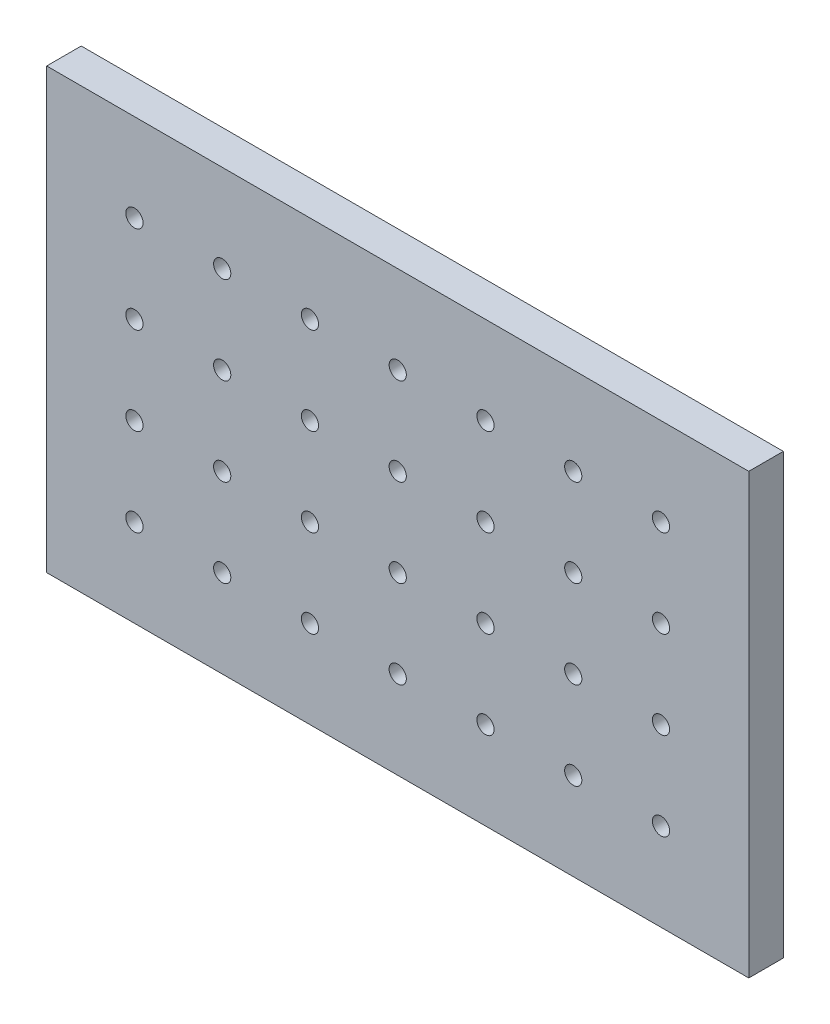
ISO-10303-21;
HEADER;
FILE_DESCRIPTION(('STEP AP214'),'2;1');
FILE_NAME('part.step','',(''),(''),'','','');
FILE_SCHEMA(('AUTOMOTIVE_DESIGN { 1 0 10303 214 1 1 1 1 }'));
ENDSEC;
DATA;
#1=APPLICATION_CONTEXT('core data for automotive mechanical design processes');
#2=APPLICATION_PROTOCOL_DEFINITION('international standard','automotive_design',2000,#1);
#3=PRODUCT_CONTEXT('',#1,'mechanical');
#4=PRODUCT('Part','Part','',(#3));
#5=PRODUCT_RELATED_PRODUCT_CATEGORY('part','',(#4));
#6=PRODUCT_DEFINITION_FORMATION('','',#4);
#7=PRODUCT_DEFINITION_CONTEXT('part definition',#1,'design');
#8=PRODUCT_DEFINITION('design','',#6,#7);
#9=PRODUCT_DEFINITION_SHAPE('','',#8);
#10=(LENGTH_UNIT() NAMED_UNIT(*) SI_UNIT(.MILLI.,.METRE.));
#11=(NAMED_UNIT(*) PLANE_ANGLE_UNIT() SI_UNIT($,.RADIAN.));
#12=(NAMED_UNIT(*) SI_UNIT($,.STERADIAN.) SOLID_ANGLE_UNIT());
#13=UNCERTAINTY_MEASURE_WITH_UNIT(LENGTH_MEASURE(1.E-05),#10,'distance_accuracy_value','');
#14=(GEOMETRIC_REPRESENTATION_CONTEXT(3) GLOBAL_UNCERTAINTY_ASSIGNED_CONTEXT((#13)) GLOBAL_UNIT_ASSIGNED_CONTEXT((#10,
#11,#12)) REPRESENTATION_CONTEXT('',''));
#15=CARTESIAN_POINT('',(0.,0.,0.));
#16=DIRECTION('',(0.,0.,1.));
#17=DIRECTION('',(1.,0.,0.));
#18=AXIS2_PLACEMENT_3D('',#15,#16,#17);
#19=CARTESIAN_POINT('',(0.,0.,10.));
#20=DIRECTION('',(-1.,0.,0.));
#21=DIRECTION('',(0.,-1.,0.));
#22=AXIS2_PLACEMENT_3D('',#19,#20,#21);
#23=PLANE('',#22);
#24=DIRECTION('',(0.,1.,0.));
#25=VECTOR('',#24,1.);
#26=CARTESIAN_POINT('',(0.,0.,0.));
#27=LINE('',#26,#25);
#28=CARTESIAN_POINT('',(0.,-127.,0.));
#29=VERTEX_POINT('',#28);
#30=CARTESIAN_POINT('',(0.,0.,0.));
#31=VERTEX_POINT('',#30);
#32=EDGE_CURVE('E98',#29,#31,#27,.T.);
#33=ORIENTED_EDGE('',*,*,#32,.T.);
#34=DIRECTION('',(0.,0.,-1.));
#35=VECTOR('',#34,1.);
#36=CARTESIAN_POINT('',(0.,0.,10.));
#37=LINE('',#36,#35);
#38=CARTESIAN_POINT('',(0.,0.,10.));
#39=VERTEX_POINT('',#38);
#40=EDGE_CURVE('E11',#39,#31,#37,.T.);
#41=ORIENTED_EDGE('',*,*,#40,.F.);
#42=DIRECTION('',(0.,1.,0.));
#43=VECTOR('',#42,1.);
#44=CARTESIAN_POINT('',(0.,0.,10.));
#45=LINE('',#44,#43);
#46=CARTESIAN_POINT('',(0.,-127.,10.));
#47=VERTEX_POINT('',#46);
#48=EDGE_CURVE('E86',#47,#39,#45,.T.);
#49=ORIENTED_EDGE('',*,*,#48,.F.);
#50=DIRECTION('',(0.,0.,-1.));
#51=VECTOR('',#50,1.);
#52=CARTESIAN_POINT('',(0.,-127.,10.));
#53=LINE('',#52,#51);
#54=EDGE_CURVE('E94',#47,#29,#53,.T.);
#55=ORIENTED_EDGE('',*,*,#54,.T.);
#56=EDGE_LOOP('',(#33,#41,#49,#55));
#57=FACE_BOUND('',#56,.T.);
#58=ADVANCED_FACE('F35',(#57),#23,.F.);
#59=CARTESIAN_POINT('',(0.,0.,10.));
#60=DIRECTION('',(0.,-1.,0.));
#61=DIRECTION('',(1.,0.,0.));
#62=AXIS2_PLACEMENT_3D('',#59,#60,#61);
#63=PLANE('',#62);
#64=DIRECTION('',(-1.,0.,0.));
#65=VECTOR('',#64,1.);
#66=CARTESIAN_POINT('',(0.,0.,0.));
#67=LINE('',#66,#65);
#68=CARTESIAN_POINT('',(-203.2,0.,0.));
#69=VERTEX_POINT('',#68);
#70=EDGE_CURVE('E90',#31,#69,#67,.T.);
#71=ORIENTED_EDGE('',*,*,#70,.T.);
#72=DIRECTION('',(0.,0.,-1.));
#73=VECTOR('',#72,1.);
#74=CARTESIAN_POINT('',(-203.2,0.,10.));
#75=LINE('',#74,#73);
#76=CARTESIAN_POINT('',(-203.2,0.,10.));
#77=VERTEX_POINT('',#76);
#78=EDGE_CURVE('E43',#77,#69,#75,.T.);
#79=ORIENTED_EDGE('',*,*,#78,.F.);
#80=DIRECTION('',(-1.,0.,0.));
#81=VECTOR('',#80,1.);
#82=CARTESIAN_POINT('',(0.,0.,10.));
#83=LINE('',#82,#81);
#84=EDGE_CURVE('E81',#39,#77,#83,.T.);
#85=ORIENTED_EDGE('',*,*,#84,.F.);
#86=ORIENTED_EDGE('',*,*,#40,.T.);
#87=EDGE_LOOP('',(#71,#79,#85,#86));
#88=FACE_BOUND('',#87,.T.);
#89=ADVANCED_FACE('F89',(#88),#63,.F.);
#90=CARTESIAN_POINT('',(-203.2,0.,10.));
#91=DIRECTION('',(1.,0.,0.));
#92=DIRECTION('',(0.,1.,0.));
#93=AXIS2_PLACEMENT_3D('',#90,#91,#92);
#94=PLANE('',#93);
#95=DIRECTION('',(0.,-1.,0.));
#96=VECTOR('',#95,1.);
#97=CARTESIAN_POINT('',(-203.2,0.,0.));
#98=LINE('',#97,#96);
#99=CARTESIAN_POINT('',(-203.2,-127.,0.));
#100=VERTEX_POINT('',#99);
#101=EDGE_CURVE('E68',#69,#100,#98,.T.);
#102=ORIENTED_EDGE('',*,*,#101,.T.);
#103=DIRECTION('',(0.,0.,-1.));
#104=VECTOR('',#103,1.);
#105=CARTESIAN_POINT('',(-203.2,-127.,10.));
#106=LINE('',#105,#104);
#107=CARTESIAN_POINT('',(-203.2,-127.,10.));
#108=VERTEX_POINT('',#107);
#109=EDGE_CURVE('E91',#108,#100,#106,.T.);
#110=ORIENTED_EDGE('',*,*,#109,.F.);
#111=DIRECTION('',(0.,-1.,0.));
#112=VECTOR('',#111,1.);
#113=CARTESIAN_POINT('',(-203.2,0.,10.));
#114=LINE('',#113,#112);
#115=EDGE_CURVE('E84',#77,#108,#114,.T.);
#116=ORIENTED_EDGE('',*,*,#115,.F.);
#117=ORIENTED_EDGE('',*,*,#78,.T.);
#118=EDGE_LOOP('',(#102,#110,#116,#117));
#119=FACE_BOUND('',#118,.T.);
#120=ADVANCED_FACE('F92',(#119),#94,.F.);
#121=CARTESIAN_POINT('',(0.,-127.,10.));
#122=DIRECTION('',(0.,1.,0.));
#123=DIRECTION('',(-1.,0.,0.));
#124=AXIS2_PLACEMENT_3D('',#121,#122,#123);
#125=PLANE('',#124);
#126=DIRECTION('',(1.,0.,0.));
#127=VECTOR('',#126,1.);
#128=CARTESIAN_POINT('',(0.,-127.,0.));
#129=LINE('',#128,#127);
#130=EDGE_CURVE('E74',#100,#29,#129,.T.);
#131=ORIENTED_EDGE('',*,*,#130,.T.);
#132=ORIENTED_EDGE('',*,*,#54,.F.);
#133=DIRECTION('',(1.,0.,0.));
#134=VECTOR('',#133,1.);
#135=CARTESIAN_POINT('',(0.,-127.,10.));
#136=LINE('',#135,#134);
#137=EDGE_CURVE('E51',#108,#47,#136,.T.);
#138=ORIENTED_EDGE('',*,*,#137,.F.);
#139=ORIENTED_EDGE('',*,*,#109,.T.);
#140=EDGE_LOOP('',(#131,#132,#138,#139));
#141=FACE_BOUND('',#140,.T.);
#142=ADVANCED_FACE('F106',(#141),#125,.F.);
#143=CARTESIAN_POINT('',(0.,0.,10.));
#144=DIRECTION('',(0.,0.,-1.));
#145=DIRECTION('',(-1.,0.,0.));
#146=AXIS2_PLACEMENT_3D('',#143,#144,#145);
#147=PLANE('',#146);
#148=CARTESIAN_POINT('',(-177.799999999999,-101.6,10.));
#149=DIRECTION('',(0.,0.,1.));
#150=DIRECTION('',(1.,0.,0.));
#151=AXIS2_PLACEMENT_3D('',#148,#149,#150);
#152=CIRCLE('',#151,2.48999999999999);
#153=CARTESIAN_POINT('',(-175.309999999999,-101.6,10.));
#154=VERTEX_POINT('',#153);
#155=EDGE_CURVE('E271',#154,#154,#152,.T.);
#156=ORIENTED_EDGE('',*,*,#155,.F.);
#157=EDGE_LOOP('',(#156));
#158=FACE_BOUND('',#157,.T.);
#159=CARTESIAN_POINT('',(-177.799999999999,-76.2,10.));
#160=DIRECTION('',(0.,0.,1.));
#161=DIRECTION('',(1.,0.,0.));
#162=AXIS2_PLACEMENT_3D('',#159,#160,#161);
#163=CIRCLE('',#162,2.48999999999999);
#164=CARTESIAN_POINT('',(-175.309999999999,-76.2,10.));
#165=VERTEX_POINT('',#164);
#166=EDGE_CURVE('E265',#165,#165,#163,.T.);
#167=ORIENTED_EDGE('',*,*,#166,.F.);
#168=EDGE_LOOP('',(#167));
#169=FACE_BOUND('',#168,.T.);
#170=CARTESIAN_POINT('',(-177.8,-50.8,10.));
#171=DIRECTION('',(0.,0.,1.));
#172=DIRECTION('',(1.,0.,0.));
#173=AXIS2_PLACEMENT_3D('',#170,#171,#172);
#174=CIRCLE('',#173,2.48999999999999);
#175=CARTESIAN_POINT('',(-175.31,-50.8,10.));
#176=VERTEX_POINT('',#175);
#177=EDGE_CURVE('E259',#176,#176,#174,.T.);
#178=ORIENTED_EDGE('',*,*,#177,.F.);
#179=EDGE_LOOP('',(#178));
#180=FACE_BOUND('',#179,.T.);
#181=CARTESIAN_POINT('',(-25.3999999999993,-101.6,10.));
#182=DIRECTION('',(0.,0.,1.));
#183=DIRECTION('',(1.,0.,0.));
#184=AXIS2_PLACEMENT_3D('',#181,#182,#183);
#185=CIRCLE('',#184,2.49);
#186=CARTESIAN_POINT('',(-22.9099999999993,-101.6,10.));
#187=VERTEX_POINT('',#186);
#188=EDGE_CURVE('E253',#187,#187,#185,.T.);
#189=ORIENTED_EDGE('',*,*,#188,.F.);
#190=EDGE_LOOP('',(#189));
#191=FACE_BOUND('',#190,.T.);
#192=CARTESIAN_POINT('',(-50.7999999999993,-101.6,10.));
#193=DIRECTION('',(0.,0.,1.));
#194=DIRECTION('',(1.,0.,0.));
#195=AXIS2_PLACEMENT_3D('',#192,#193,#194);
#196=CIRCLE('',#195,2.49);
#197=CARTESIAN_POINT('',(-48.3099999999993,-101.6,10.));
#198=VERTEX_POINT('',#197);
#199=EDGE_CURVE('E247',#198,#198,#196,.T.);
#200=ORIENTED_EDGE('',*,*,#199,.F.);
#201=EDGE_LOOP('',(#200));
#202=FACE_BOUND('',#201,.T.);
#203=CARTESIAN_POINT('',(-76.1999999999993,-101.6,10.));
#204=DIRECTION('',(0.,0.,1.));
#205=DIRECTION('',(1.,0.,0.));
#206=AXIS2_PLACEMENT_3D('',#203,#204,#205);
#207=CIRCLE('',#206,2.49000000000001);
#208=CARTESIAN_POINT('',(-73.7099999999993,-101.6,10.));
#209=VERTEX_POINT('',#208);
#210=EDGE_CURVE('E241',#209,#209,#207,.T.);
#211=ORIENTED_EDGE('',*,*,#210,.F.);
#212=EDGE_LOOP('',(#211));
#213=FACE_BOUND('',#212,.T.);
#214=CARTESIAN_POINT('',(-101.599999999999,-101.6,10.));
#215=DIRECTION('',(0.,0.,1.));
#216=DIRECTION('',(1.,0.,0.));
#217=AXIS2_PLACEMENT_3D('',#214,#215,#216);
#218=CIRCLE('',#217,2.49000000000001);
#219=CARTESIAN_POINT('',(-99.1099999999993,-101.6,10.));
#220=VERTEX_POINT('',#219);
#221=EDGE_CURVE('E235',#220,#220,#218,.T.);
#222=ORIENTED_EDGE('',*,*,#221,.F.);
#223=EDGE_LOOP('',(#222));
#224=FACE_BOUND('',#223,.T.);
#225=CARTESIAN_POINT('',(-126.999999999999,-101.6,10.));
#226=DIRECTION('',(0.,0.,1.));
#227=DIRECTION('',(1.,0.,0.));
#228=AXIS2_PLACEMENT_3D('',#225,#226,#227);
#229=CIRCLE('',#228,2.49000000000001);
#230=CARTESIAN_POINT('',(-124.509999999999,-101.6,10.));
#231=VERTEX_POINT('',#230);
#232=EDGE_CURVE('E229',#231,#231,#229,.T.);
#233=ORIENTED_EDGE('',*,*,#232,.F.);
#234=EDGE_LOOP('',(#233));
#235=FACE_BOUND('',#234,.T.);
#236=CARTESIAN_POINT('',(-152.399999999999,-101.6,10.));
#237=DIRECTION('',(0.,0.,1.));
#238=DIRECTION('',(1.,0.,0.));
#239=AXIS2_PLACEMENT_3D('',#236,#237,#238);
#240=CIRCLE('',#239,2.48999999999999);
#241=CARTESIAN_POINT('',(-149.909999999999,-101.6,10.));
#242=VERTEX_POINT('',#241);
#243=EDGE_CURVE('E223',#242,#242,#240,.T.);
#244=ORIENTED_EDGE('',*,*,#243,.F.);
#245=EDGE_LOOP('',(#244));
#246=FACE_BOUND('',#245,.T.);
#247=CARTESIAN_POINT('',(-25.3999999999996,-76.2,10.));
#248=DIRECTION('',(0.,0.,1.));
#249=DIRECTION('',(1.,0.,0.));
#250=AXIS2_PLACEMENT_3D('',#247,#248,#249);
#251=CIRCLE('',#250,2.49);
#252=CARTESIAN_POINT('',(-22.9099999999996,-76.2,10.));
#253=VERTEX_POINT('',#252);
#254=EDGE_CURVE('E217',#253,#253,#251,.T.);
#255=ORIENTED_EDGE('',*,*,#254,.F.);
#256=EDGE_LOOP('',(#255));
#257=FACE_BOUND('',#256,.T.);
#258=CARTESIAN_POINT('',(-50.7999999999996,-76.2,10.));
#259=DIRECTION('',(0.,0.,1.));
#260=DIRECTION('',(1.,0.,0.));
#261=AXIS2_PLACEMENT_3D('',#258,#259,#260);
#262=CIRCLE('',#261,2.49);
#263=CARTESIAN_POINT('',(-48.3099999999996,-76.2,10.));
#264=VERTEX_POINT('',#263);
#265=EDGE_CURVE('E211',#264,#264,#262,.T.);
#266=ORIENTED_EDGE('',*,*,#265,.F.);
#267=EDGE_LOOP('',(#266));
#268=FACE_BOUND('',#267,.T.);
#269=CARTESIAN_POINT('',(-76.1999999999996,-76.2,10.));
#270=DIRECTION('',(0.,0.,1.));
#271=DIRECTION('',(1.,0.,0.));
#272=AXIS2_PLACEMENT_3D('',#269,#270,#271);
#273=CIRCLE('',#272,2.49000000000001);
#274=CARTESIAN_POINT('',(-73.7099999999996,-76.2,10.));
#275=VERTEX_POINT('',#274);
#276=EDGE_CURVE('E205',#275,#275,#273,.T.);
#277=ORIENTED_EDGE('',*,*,#276,.F.);
#278=EDGE_LOOP('',(#277));
#279=FACE_BOUND('',#278,.T.);
#280=CARTESIAN_POINT('',(-101.6,-76.2,10.));
#281=DIRECTION('',(0.,0.,1.));
#282=DIRECTION('',(1.,0.,0.));
#283=AXIS2_PLACEMENT_3D('',#280,#281,#282);
#284=CIRCLE('',#283,2.49000000000001);
#285=CARTESIAN_POINT('',(-99.1099999999995,-76.2,10.));
#286=VERTEX_POINT('',#285);
#287=EDGE_CURVE('E199',#286,#286,#284,.T.);
#288=ORIENTED_EDGE('',*,*,#287,.F.);
#289=EDGE_LOOP('',(#288));
#290=FACE_BOUND('',#289,.T.);
#291=CARTESIAN_POINT('',(-127.,-76.2,10.));
#292=DIRECTION('',(0.,0.,1.));
#293=DIRECTION('',(1.,0.,0.));
#294=AXIS2_PLACEMENT_3D('',#291,#292,#293);
#295=CIRCLE('',#294,2.49000000000001);
#296=CARTESIAN_POINT('',(-124.509999999999,-76.2,10.));
#297=VERTEX_POINT('',#296);
#298=EDGE_CURVE('E193',#297,#297,#295,.T.);
#299=ORIENTED_EDGE('',*,*,#298,.F.);
#300=EDGE_LOOP('',(#299));
#301=FACE_BOUND('',#300,.T.);
#302=CARTESIAN_POINT('',(-152.399999999999,-76.2,10.));
#303=DIRECTION('',(0.,0.,1.));
#304=DIRECTION('',(1.,0.,0.));
#305=AXIS2_PLACEMENT_3D('',#302,#303,#304);
#306=CIRCLE('',#305,2.48999999999999);
#307=CARTESIAN_POINT('',(-149.909999999999,-76.2,10.));
#308=VERTEX_POINT('',#307);
#309=EDGE_CURVE('E187',#308,#308,#306,.T.);
#310=ORIENTED_EDGE('',*,*,#309,.F.);
#311=EDGE_LOOP('',(#310));
#312=FACE_BOUND('',#311,.T.);
#313=CARTESIAN_POINT('',(-25.3999999999999,-50.8,10.));
#314=DIRECTION('',(0.,0.,1.));
#315=DIRECTION('',(1.,0.,0.));
#316=AXIS2_PLACEMENT_3D('',#313,#314,#315);
#317=CIRCLE('',#316,2.49);
#318=CARTESIAN_POINT('',(-22.9099999999999,-50.8,10.));
#319=VERTEX_POINT('',#318);
#320=EDGE_CURVE('E181',#319,#319,#317,.T.);
#321=ORIENTED_EDGE('',*,*,#320,.F.);
#322=EDGE_LOOP('',(#321));
#323=FACE_BOUND('',#322,.T.);
#324=CARTESIAN_POINT('',(-50.7999999999998,-50.8,10.));
#325=DIRECTION('',(0.,0.,1.));
#326=DIRECTION('',(1.,0.,0.));
#327=AXIS2_PLACEMENT_3D('',#324,#325,#326);
#328=CIRCLE('',#327,2.49);
#329=CARTESIAN_POINT('',(-48.3099999999998,-50.8,10.));
#330=VERTEX_POINT('',#329);
#331=EDGE_CURVE('E175',#330,#330,#328,.T.);
#332=ORIENTED_EDGE('',*,*,#331,.F.);
#333=EDGE_LOOP('',(#332));
#334=FACE_BOUND('',#333,.T.);
#335=CARTESIAN_POINT('',(-76.1999999999998,-50.8,10.));
#336=DIRECTION('',(0.,0.,1.));
#337=DIRECTION('',(1.,0.,0.));
#338=AXIS2_PLACEMENT_3D('',#335,#336,#337);
#339=CIRCLE('',#338,2.49000000000001);
#340=CARTESIAN_POINT('',(-73.7099999999998,-50.8,10.));
#341=VERTEX_POINT('',#340);
#342=EDGE_CURVE('E169',#341,#341,#339,.T.);
#343=ORIENTED_EDGE('',*,*,#342,.F.);
#344=EDGE_LOOP('',(#343));
#345=FACE_BOUND('',#344,.T.);
#346=CARTESIAN_POINT('',(-101.6,-50.8,10.));
#347=DIRECTION('',(0.,0.,1.));
#348=DIRECTION('',(1.,0.,0.));
#349=AXIS2_PLACEMENT_3D('',#346,#347,#348);
#350=CIRCLE('',#349,2.49000000000001);
#351=CARTESIAN_POINT('',(-99.1099999999998,-50.8,10.));
#352=VERTEX_POINT('',#351);
#353=EDGE_CURVE('E163',#352,#352,#350,.T.);
#354=ORIENTED_EDGE('',*,*,#353,.F.);
#355=EDGE_LOOP('',(#354));
#356=FACE_BOUND('',#355,.T.);
#357=CARTESIAN_POINT('',(-127.,-50.8,10.));
#358=DIRECTION('',(0.,0.,1.));
#359=DIRECTION('',(1.,0.,0.));
#360=AXIS2_PLACEMENT_3D('',#357,#358,#359);
#361=CIRCLE('',#360,2.49000000000001);
#362=CARTESIAN_POINT('',(-124.51,-50.8,10.));
#363=VERTEX_POINT('',#362);
#364=EDGE_CURVE('E157',#363,#363,#361,.T.);
#365=ORIENTED_EDGE('',*,*,#364,.F.);
#366=EDGE_LOOP('',(#365));
#367=FACE_BOUND('',#366,.T.);
#368=CARTESIAN_POINT('',(-152.4,-50.8,10.));
#369=DIRECTION('',(0.,0.,1.));
#370=DIRECTION('',(1.,0.,0.));
#371=AXIS2_PLACEMENT_3D('',#368,#369,#370);
#372=CIRCLE('',#371,2.48999999999999);
#373=CARTESIAN_POINT('',(-149.91,-50.8,10.));
#374=VERTEX_POINT('',#373);
#375=EDGE_CURVE('E151',#374,#374,#372,.T.);
#376=ORIENTED_EDGE('',*,*,#375,.F.);
#377=EDGE_LOOP('',(#376));
#378=FACE_BOUND('',#377,.T.);
#379=CARTESIAN_POINT('',(-25.4000000000001,-25.4,10.));
#380=DIRECTION('',(0.,0.,1.));
#381=DIRECTION('',(1.,0.,0.));
#382=AXIS2_PLACEMENT_3D('',#379,#380,#381);
#383=CIRCLE('',#382,2.49);
#384=CARTESIAN_POINT('',(-22.9100000000001,-25.4,10.));
#385=VERTEX_POINT('',#384);
#386=EDGE_CURVE('E145',#385,#385,#383,.T.);
#387=ORIENTED_EDGE('',*,*,#386,.F.);
#388=EDGE_LOOP('',(#387));
#389=FACE_BOUND('',#388,.T.);
#390=CARTESIAN_POINT('',(-50.8000000000001,-25.4,10.));
#391=DIRECTION('',(0.,0.,1.));
#392=DIRECTION('',(1.,0.,0.));
#393=AXIS2_PLACEMENT_3D('',#390,#391,#392);
#394=CIRCLE('',#393,2.49);
#395=CARTESIAN_POINT('',(-48.3100000000001,-25.4,10.));
#396=VERTEX_POINT('',#395);
#397=EDGE_CURVE('E139',#396,#396,#394,.T.);
#398=ORIENTED_EDGE('',*,*,#397,.F.);
#399=EDGE_LOOP('',(#398));
#400=FACE_BOUND('',#399,.T.);
#401=CARTESIAN_POINT('',(-76.2000000000001,-25.4,10.));
#402=DIRECTION('',(0.,0.,1.));
#403=DIRECTION('',(1.,0.,0.));
#404=AXIS2_PLACEMENT_3D('',#401,#402,#403);
#405=CIRCLE('',#404,2.49000000000001);
#406=CARTESIAN_POINT('',(-73.7100000000001,-25.4,10.));
#407=VERTEX_POINT('',#406);
#408=EDGE_CURVE('E133',#407,#407,#405,.T.);
#409=ORIENTED_EDGE('',*,*,#408,.F.);
#410=EDGE_LOOP('',(#409));
#411=FACE_BOUND('',#410,.T.);
#412=CARTESIAN_POINT('',(-101.6,-25.4,10.));
#413=DIRECTION('',(0.,0.,1.));
#414=DIRECTION('',(1.,0.,0.));
#415=AXIS2_PLACEMENT_3D('',#412,#413,#414);
#416=CIRCLE('',#415,2.49000000000001);
#417=CARTESIAN_POINT('',(-99.1100000000001,-25.4,10.));
#418=VERTEX_POINT('',#417);
#419=EDGE_CURVE('E127',#418,#418,#416,.T.);
#420=ORIENTED_EDGE('',*,*,#419,.F.);
#421=EDGE_LOOP('',(#420));
#422=FACE_BOUND('',#421,.T.);
#423=CARTESIAN_POINT('',(-127.,-25.4,10.));
#424=DIRECTION('',(0.,0.,1.));
#425=DIRECTION('',(1.,0.,0.));
#426=AXIS2_PLACEMENT_3D('',#423,#424,#425);
#427=CIRCLE('',#426,2.49000000000001);
#428=CARTESIAN_POINT('',(-124.51,-25.4,10.));
#429=VERTEX_POINT('',#428);
#430=EDGE_CURVE('E121',#429,#429,#427,.T.);
#431=ORIENTED_EDGE('',*,*,#430,.F.);
#432=EDGE_LOOP('',(#431));
#433=FACE_BOUND('',#432,.T.);
#434=CARTESIAN_POINT('',(-152.4,-25.4,10.));
#435=DIRECTION('',(0.,0.,1.));
#436=DIRECTION('',(1.,0.,0.));
#437=AXIS2_PLACEMENT_3D('',#434,#435,#436);
#438=CIRCLE('',#437,2.48999999999998);
#439=CARTESIAN_POINT('',(-149.91,-25.4,10.));
#440=VERTEX_POINT('',#439);
#441=EDGE_CURVE('E115',#440,#440,#438,.T.);
#442=ORIENTED_EDGE('',*,*,#441,.F.);
#443=EDGE_LOOP('',(#442));
#444=FACE_BOUND('',#443,.T.);
#445=CARTESIAN_POINT('',(-177.8,-25.4,10.));
#446=DIRECTION('',(0.,0.,1.));
#447=DIRECTION('',(1.,0.,0.));
#448=AXIS2_PLACEMENT_3D('',#445,#446,#447);
#449=CIRCLE('',#448,2.48999999999998);
#450=CARTESIAN_POINT('',(-175.31,-25.4,10.));
#451=VERTEX_POINT('',#450);
#452=EDGE_CURVE('E101',#451,#451,#449,.T.);
#453=ORIENTED_EDGE('',*,*,#452,.F.);
#454=EDGE_LOOP('',(#453));
#455=FACE_BOUND('',#454,.T.);
#456=ORIENTED_EDGE('',*,*,#48,.T.);
#457=ORIENTED_EDGE('',*,*,#84,.T.);
#458=ORIENTED_EDGE('',*,*,#115,.T.);
#459=ORIENTED_EDGE('',*,*,#137,.T.);
#460=EDGE_LOOP('',(#456,#457,#458,#459));
#461=FACE_BOUND('',#460,.T.);
#462=ADVANCED_FACE('F82',(#158,#169,#180,#191,#202,#213,#224,#235,#246,#257,#268,#279,#290,#301,
#312,#323,#334,#345,#356,#367,#378,#389,#400,#411,#422,#433,#444,#455,#461),#147,.F.);
#463=CARTESIAN_POINT('',(0.,0.,0.));
#464=DIRECTION('',(0.,0.,-1.));
#465=DIRECTION('',(-1.,0.,0.));
#466=AXIS2_PLACEMENT_3D('',#463,#464,#465);
#467=PLANE('',#466);
#468=CARTESIAN_POINT('',(-177.799999999999,-101.6,0.));
#469=DIRECTION('',(0.,0.,-1.));
#470=DIRECTION('',(-1.,0.,0.));
#471=AXIS2_PLACEMENT_3D('',#468,#469,#470);
#472=CIRCLE('',#471,2.48999999999999);
#473=CARTESIAN_POINT('',(-180.289999999999,-101.6,0.));
#474=VERTEX_POINT('',#473);
#475=EDGE_CURVE('E274',#474,#474,#472,.F.);
#476=ORIENTED_EDGE('',*,*,#475,.T.);
#477=EDGE_LOOP('',(#476));
#478=FACE_BOUND('',#477,.T.);
#479=CARTESIAN_POINT('',(-177.799999999999,-76.2,0.));
#480=DIRECTION('',(0.,0.,-1.));
#481=DIRECTION('',(-1.,0.,0.));
#482=AXIS2_PLACEMENT_3D('',#479,#480,#481);
#483=CIRCLE('',#482,2.48999999999999);
#484=CARTESIAN_POINT('',(-180.289999999999,-76.2,0.));
#485=VERTEX_POINT('',#484);
#486=EDGE_CURVE('E268',#485,#485,#483,.F.);
#487=ORIENTED_EDGE('',*,*,#486,.T.);
#488=EDGE_LOOP('',(#487));
#489=FACE_BOUND('',#488,.T.);
#490=CARTESIAN_POINT('',(-177.8,-50.8,0.));
#491=DIRECTION('',(0.,0.,-1.));
#492=DIRECTION('',(-1.,0.,0.));
#493=AXIS2_PLACEMENT_3D('',#490,#491,#492);
#494=CIRCLE('',#493,2.48999999999999);
#495=CARTESIAN_POINT('',(-180.29,-50.8,0.));
#496=VERTEX_POINT('',#495);
#497=EDGE_CURVE('E262',#496,#496,#494,.F.);
#498=ORIENTED_EDGE('',*,*,#497,.T.);
#499=EDGE_LOOP('',(#498));
#500=FACE_BOUND('',#499,.T.);
#501=CARTESIAN_POINT('',(-25.3999999999993,-101.6,0.));
#502=DIRECTION('',(0.,0.,-1.));
#503=DIRECTION('',(-1.,0.,0.));
#504=AXIS2_PLACEMENT_3D('',#501,#502,#503);
#505=CIRCLE('',#504,2.49);
#506=CARTESIAN_POINT('',(-27.8899999999993,-101.6,0.));
#507=VERTEX_POINT('',#506);
#508=EDGE_CURVE('E256',#507,#507,#505,.F.);
#509=ORIENTED_EDGE('',*,*,#508,.T.);
#510=EDGE_LOOP('',(#509));
#511=FACE_BOUND('',#510,.T.);
#512=CARTESIAN_POINT('',(-50.7999999999993,-101.6,0.));
#513=DIRECTION('',(0.,0.,-1.));
#514=DIRECTION('',(-1.,0.,0.));
#515=AXIS2_PLACEMENT_3D('',#512,#513,#514);
#516=CIRCLE('',#515,2.49);
#517=CARTESIAN_POINT('',(-53.2899999999993,-101.6,0.));
#518=VERTEX_POINT('',#517);
#519=EDGE_CURVE('E250',#518,#518,#516,.F.);
#520=ORIENTED_EDGE('',*,*,#519,.T.);
#521=EDGE_LOOP('',(#520));
#522=FACE_BOUND('',#521,.T.);
#523=CARTESIAN_POINT('',(-76.1999999999993,-101.6,0.));
#524=DIRECTION('',(0.,0.,-1.));
#525=DIRECTION('',(-1.,0.,0.));
#526=AXIS2_PLACEMENT_3D('',#523,#524,#525);
#527=CIRCLE('',#526,2.49000000000001);
#528=CARTESIAN_POINT('',(-78.6899999999993,-101.6,0.));
#529=VERTEX_POINT('',#528);
#530=EDGE_CURVE('E244',#529,#529,#527,.F.);
#531=ORIENTED_EDGE('',*,*,#530,.T.);
#532=EDGE_LOOP('',(#531));
#533=FACE_BOUND('',#532,.T.);
#534=CARTESIAN_POINT('',(-101.599999999999,-101.6,0.));
#535=DIRECTION('',(0.,0.,-1.));
#536=DIRECTION('',(-1.,0.,0.));
#537=AXIS2_PLACEMENT_3D('',#534,#535,#536);
#538=CIRCLE('',#537,2.49000000000001);
#539=CARTESIAN_POINT('',(-104.089999999999,-101.6,0.));
#540=VERTEX_POINT('',#539);
#541=EDGE_CURVE('E238',#540,#540,#538,.F.);
#542=ORIENTED_EDGE('',*,*,#541,.T.);
#543=EDGE_LOOP('',(#542));
#544=FACE_BOUND('',#543,.T.);
#545=CARTESIAN_POINT('',(-126.999999999999,-101.6,0.));
#546=DIRECTION('',(0.,0.,-1.));
#547=DIRECTION('',(-1.,0.,0.));
#548=AXIS2_PLACEMENT_3D('',#545,#546,#547);
#549=CIRCLE('',#548,2.49000000000001);
#550=CARTESIAN_POINT('',(-129.489999999999,-101.6,0.));
#551=VERTEX_POINT('',#550);
#552=EDGE_CURVE('E232',#551,#551,#549,.F.);
#553=ORIENTED_EDGE('',*,*,#552,.T.);
#554=EDGE_LOOP('',(#553));
#555=FACE_BOUND('',#554,.T.);
#556=CARTESIAN_POINT('',(-152.399999999999,-101.6,0.));
#557=DIRECTION('',(0.,0.,-1.));
#558=DIRECTION('',(-1.,0.,0.));
#559=AXIS2_PLACEMENT_3D('',#556,#557,#558);
#560=CIRCLE('',#559,2.48999999999999);
#561=CARTESIAN_POINT('',(-154.889999999999,-101.6,0.));
#562=VERTEX_POINT('',#561);
#563=EDGE_CURVE('E226',#562,#562,#560,.F.);
#564=ORIENTED_EDGE('',*,*,#563,.T.);
#565=EDGE_LOOP('',(#564));
#566=FACE_BOUND('',#565,.T.);
#567=CARTESIAN_POINT('',(-25.3999999999996,-76.2,0.));
#568=DIRECTION('',(0.,0.,-1.));
#569=DIRECTION('',(-1.,0.,0.));
#570=AXIS2_PLACEMENT_3D('',#567,#568,#569);
#571=CIRCLE('',#570,2.49);
#572=CARTESIAN_POINT('',(-27.8899999999996,-76.2,0.));
#573=VERTEX_POINT('',#572);
#574=EDGE_CURVE('E220',#573,#573,#571,.F.);
#575=ORIENTED_EDGE('',*,*,#574,.T.);
#576=EDGE_LOOP('',(#575));
#577=FACE_BOUND('',#576,.T.);
#578=CARTESIAN_POINT('',(-50.7999999999996,-76.2,0.));
#579=DIRECTION('',(0.,0.,-1.));
#580=DIRECTION('',(-1.,0.,0.));
#581=AXIS2_PLACEMENT_3D('',#578,#579,#580);
#582=CIRCLE('',#581,2.49);
#583=CARTESIAN_POINT('',(-53.2899999999996,-76.2,0.));
#584=VERTEX_POINT('',#583);
#585=EDGE_CURVE('E214',#584,#584,#582,.F.);
#586=ORIENTED_EDGE('',*,*,#585,.T.);
#587=EDGE_LOOP('',(#586));
#588=FACE_BOUND('',#587,.T.);
#589=CARTESIAN_POINT('',(-76.1999999999996,-76.2,0.));
#590=DIRECTION('',(0.,0.,-1.));
#591=DIRECTION('',(-1.,0.,0.));
#592=AXIS2_PLACEMENT_3D('',#589,#590,#591);
#593=CIRCLE('',#592,2.49000000000001);
#594=CARTESIAN_POINT('',(-78.6899999999996,-76.2,0.));
#595=VERTEX_POINT('',#594);
#596=EDGE_CURVE('E208',#595,#595,#593,.F.);
#597=ORIENTED_EDGE('',*,*,#596,.T.);
#598=EDGE_LOOP('',(#597));
#599=FACE_BOUND('',#598,.T.);
#600=CARTESIAN_POINT('',(-101.6,-76.2,0.));
#601=DIRECTION('',(0.,0.,-1.));
#602=DIRECTION('',(-1.,0.,0.));
#603=AXIS2_PLACEMENT_3D('',#600,#601,#602);
#604=CIRCLE('',#603,2.49000000000001);
#605=CARTESIAN_POINT('',(-104.09,-76.2,0.));
#606=VERTEX_POINT('',#605);
#607=EDGE_CURVE('E202',#606,#606,#604,.F.);
#608=ORIENTED_EDGE('',*,*,#607,.T.);
#609=EDGE_LOOP('',(#608));
#610=FACE_BOUND('',#609,.T.);
#611=CARTESIAN_POINT('',(-127.,-76.2,0.));
#612=DIRECTION('',(0.,0.,-1.));
#613=DIRECTION('',(-1.,0.,0.));
#614=AXIS2_PLACEMENT_3D('',#611,#612,#613);
#615=CIRCLE('',#614,2.49000000000001);
#616=CARTESIAN_POINT('',(-129.49,-76.2,0.));
#617=VERTEX_POINT('',#616);
#618=EDGE_CURVE('E196',#617,#617,#615,.F.);
#619=ORIENTED_EDGE('',*,*,#618,.T.);
#620=EDGE_LOOP('',(#619));
#621=FACE_BOUND('',#620,.T.);
#622=CARTESIAN_POINT('',(-152.399999999999,-76.2,0.));
#623=DIRECTION('',(0.,0.,-1.));
#624=DIRECTION('',(-1.,0.,0.));
#625=AXIS2_PLACEMENT_3D('',#622,#623,#624);
#626=CIRCLE('',#625,2.48999999999999);
#627=CARTESIAN_POINT('',(-154.889999999999,-76.2,0.));
#628=VERTEX_POINT('',#627);
#629=EDGE_CURVE('E190',#628,#628,#626,.F.);
#630=ORIENTED_EDGE('',*,*,#629,.T.);
#631=EDGE_LOOP('',(#630));
#632=FACE_BOUND('',#631,.T.);
#633=CARTESIAN_POINT('',(-25.3999999999999,-50.8,0.));
#634=DIRECTION('',(0.,0.,-1.));
#635=DIRECTION('',(-1.,0.,0.));
#636=AXIS2_PLACEMENT_3D('',#633,#634,#635);
#637=CIRCLE('',#636,2.49);
#638=CARTESIAN_POINT('',(-27.8899999999999,-50.8,0.));
#639=VERTEX_POINT('',#638);
#640=EDGE_CURVE('E184',#639,#639,#637,.F.);
#641=ORIENTED_EDGE('',*,*,#640,.T.);
#642=EDGE_LOOP('',(#641));
#643=FACE_BOUND('',#642,.T.);
#644=CARTESIAN_POINT('',(-50.7999999999998,-50.8,0.));
#645=DIRECTION('',(0.,0.,-1.));
#646=DIRECTION('',(-1.,0.,0.));
#647=AXIS2_PLACEMENT_3D('',#644,#645,#646);
#648=CIRCLE('',#647,2.49);
#649=CARTESIAN_POINT('',(-53.2899999999998,-50.8,0.));
#650=VERTEX_POINT('',#649);
#651=EDGE_CURVE('E178',#650,#650,#648,.F.);
#652=ORIENTED_EDGE('',*,*,#651,.T.);
#653=EDGE_LOOP('',(#652));
#654=FACE_BOUND('',#653,.T.);
#655=CARTESIAN_POINT('',(-76.1999999999998,-50.8,0.));
#656=DIRECTION('',(0.,0.,-1.));
#657=DIRECTION('',(-1.,0.,0.));
#658=AXIS2_PLACEMENT_3D('',#655,#656,#657);
#659=CIRCLE('',#658,2.49000000000001);
#660=CARTESIAN_POINT('',(-78.6899999999998,-50.8,0.));
#661=VERTEX_POINT('',#660);
#662=EDGE_CURVE('E172',#661,#661,#659,.F.);
#663=ORIENTED_EDGE('',*,*,#662,.T.);
#664=EDGE_LOOP('',(#663));
#665=FACE_BOUND('',#664,.T.);
#666=CARTESIAN_POINT('',(-101.6,-50.8,0.));
#667=DIRECTION('',(0.,0.,-1.));
#668=DIRECTION('',(-1.,0.,0.));
#669=AXIS2_PLACEMENT_3D('',#666,#667,#668);
#670=CIRCLE('',#669,2.49000000000001);
#671=CARTESIAN_POINT('',(-104.09,-50.8,0.));
#672=VERTEX_POINT('',#671);
#673=EDGE_CURVE('E166',#672,#672,#670,.F.);
#674=ORIENTED_EDGE('',*,*,#673,.T.);
#675=EDGE_LOOP('',(#674));
#676=FACE_BOUND('',#675,.T.);
#677=CARTESIAN_POINT('',(-127.,-50.8,0.));
#678=DIRECTION('',(0.,0.,-1.));
#679=DIRECTION('',(-1.,0.,0.));
#680=AXIS2_PLACEMENT_3D('',#677,#678,#679);
#681=CIRCLE('',#680,2.49000000000001);
#682=CARTESIAN_POINT('',(-129.49,-50.8,0.));
#683=VERTEX_POINT('',#682);
#684=EDGE_CURVE('E160',#683,#683,#681,.F.);
#685=ORIENTED_EDGE('',*,*,#684,.T.);
#686=EDGE_LOOP('',(#685));
#687=FACE_BOUND('',#686,.T.);
#688=CARTESIAN_POINT('',(-152.4,-50.8,0.));
#689=DIRECTION('',(0.,0.,-1.));
#690=DIRECTION('',(-1.,0.,0.));
#691=AXIS2_PLACEMENT_3D('',#688,#689,#690);
#692=CIRCLE('',#691,2.48999999999999);
#693=CARTESIAN_POINT('',(-154.89,-50.8,0.));
#694=VERTEX_POINT('',#693);
#695=EDGE_CURVE('E154',#694,#694,#692,.F.);
#696=ORIENTED_EDGE('',*,*,#695,.T.);
#697=EDGE_LOOP('',(#696));
#698=FACE_BOUND('',#697,.T.);
#699=CARTESIAN_POINT('',(-25.4000000000001,-25.4,0.));
#700=DIRECTION('',(0.,0.,-1.));
#701=DIRECTION('',(-1.,0.,0.));
#702=AXIS2_PLACEMENT_3D('',#699,#700,#701);
#703=CIRCLE('',#702,2.49);
#704=CARTESIAN_POINT('',(-27.8900000000001,-25.4,0.));
#705=VERTEX_POINT('',#704);
#706=EDGE_CURVE('E148',#705,#705,#703,.F.);
#707=ORIENTED_EDGE('',*,*,#706,.T.);
#708=EDGE_LOOP('',(#707));
#709=FACE_BOUND('',#708,.T.);
#710=CARTESIAN_POINT('',(-50.8000000000001,-25.4,0.));
#711=DIRECTION('',(0.,0.,-1.));
#712=DIRECTION('',(-1.,0.,0.));
#713=AXIS2_PLACEMENT_3D('',#710,#711,#712);
#714=CIRCLE('',#713,2.49);
#715=CARTESIAN_POINT('',(-53.2900000000001,-25.4,0.));
#716=VERTEX_POINT('',#715);
#717=EDGE_CURVE('E142',#716,#716,#714,.F.);
#718=ORIENTED_EDGE('',*,*,#717,.T.);
#719=EDGE_LOOP('',(#718));
#720=FACE_BOUND('',#719,.T.);
#721=CARTESIAN_POINT('',(-76.2000000000001,-25.4,0.));
#722=DIRECTION('',(0.,0.,-1.));
#723=DIRECTION('',(-1.,0.,0.));
#724=AXIS2_PLACEMENT_3D('',#721,#722,#723);
#725=CIRCLE('',#724,2.49000000000001);
#726=CARTESIAN_POINT('',(-78.6900000000001,-25.4,0.));
#727=VERTEX_POINT('',#726);
#728=EDGE_CURVE('E136',#727,#727,#725,.F.);
#729=ORIENTED_EDGE('',*,*,#728,.T.);
#730=EDGE_LOOP('',(#729));
#731=FACE_BOUND('',#730,.T.);
#732=CARTESIAN_POINT('',(-101.6,-25.4,0.));
#733=DIRECTION('',(0.,0.,-1.));
#734=DIRECTION('',(-1.,0.,0.));
#735=AXIS2_PLACEMENT_3D('',#732,#733,#734);
#736=CIRCLE('',#735,2.49000000000001);
#737=CARTESIAN_POINT('',(-104.09,-25.4,0.));
#738=VERTEX_POINT('',#737);
#739=EDGE_CURVE('E130',#738,#738,#736,.F.);
#740=ORIENTED_EDGE('',*,*,#739,.T.);
#741=EDGE_LOOP('',(#740));
#742=FACE_BOUND('',#741,.T.);
#743=CARTESIAN_POINT('',(-127.,-25.4,0.));
#744=DIRECTION('',(0.,0.,-1.));
#745=DIRECTION('',(-1.,0.,0.));
#746=AXIS2_PLACEMENT_3D('',#743,#744,#745);
#747=CIRCLE('',#746,2.49000000000001);
#748=CARTESIAN_POINT('',(-129.49,-25.4,0.));
#749=VERTEX_POINT('',#748);
#750=EDGE_CURVE('E124',#749,#749,#747,.F.);
#751=ORIENTED_EDGE('',*,*,#750,.T.);
#752=EDGE_LOOP('',(#751));
#753=FACE_BOUND('',#752,.T.);
#754=CARTESIAN_POINT('',(-152.4,-25.4,0.));
#755=DIRECTION('',(0.,0.,-1.));
#756=DIRECTION('',(-1.,0.,0.));
#757=AXIS2_PLACEMENT_3D('',#754,#755,#756);
#758=CIRCLE('',#757,2.48999999999998);
#759=CARTESIAN_POINT('',(-154.89,-25.4,0.));
#760=VERTEX_POINT('',#759);
#761=EDGE_CURVE('E118',#760,#760,#758,.F.);
#762=ORIENTED_EDGE('',*,*,#761,.T.);
#763=EDGE_LOOP('',(#762));
#764=FACE_BOUND('',#763,.T.);
#765=CARTESIAN_POINT('',(-177.8,-25.4,0.));
#766=DIRECTION('',(0.,0.,-1.));
#767=DIRECTION('',(-1.,0.,0.));
#768=AXIS2_PLACEMENT_3D('',#765,#766,#767);
#769=CIRCLE('',#768,2.48999999999998);
#770=CARTESIAN_POINT('',(-180.29,-25.4,0.));
#771=VERTEX_POINT('',#770);
#772=EDGE_CURVE('E112',#771,#771,#769,.F.);
#773=ORIENTED_EDGE('',*,*,#772,.T.);
#774=EDGE_LOOP('',(#773));
#775=FACE_BOUND('',#774,.T.);
#776=ORIENTED_EDGE('',*,*,#32,.F.);
#777=ORIENTED_EDGE('',*,*,#130,.F.);
#778=ORIENTED_EDGE('',*,*,#101,.F.);
#779=ORIENTED_EDGE('',*,*,#70,.F.);
#780=EDGE_LOOP('',(#776,#777,#778,#779));
#781=FACE_BOUND('',#780,.T.);
#782=ADVANCED_FACE('F109',(#478,#489,#500,#511,#522,#533,#544,#555,#566,#577,#588,#599,#610,
#621,#632,#643,#654,#665,#676,#687,#698,#709,#720,#731,#742,#753,#764,#775,#781),#467,.T.);
#783=CARTESIAN_POINT('',(-177.8,-25.4,-0.000999999999999265));
#784=DIRECTION('',(0.,0.,1.));
#785=DIRECTION('',(1.,0.,0.));
#786=AXIS2_PLACEMENT_3D('',#783,#784,#785);
#787=CYLINDRICAL_SURFACE('',#786,2.48999999999998);
#788=ORIENTED_EDGE('',*,*,#772,.F.);
#789=EDGE_LOOP('',(#788));
#790=FACE_BOUND('',#789,.T.);
#791=ORIENTED_EDGE('',*,*,#452,.T.);
#792=EDGE_LOOP('',(#791));
#793=FACE_BOUND('',#792,.T.);
#794=ADVANCED_FACE('F339',(#790,#793),#787,.F.);
#795=CARTESIAN_POINT('',(-152.4,-25.4,-0.000999999999999265));
#796=DIRECTION('',(0.,0.,1.));
#797=DIRECTION('',(1.,0.,0.));
#798=AXIS2_PLACEMENT_3D('',#795,#796,#797);
#799=CYLINDRICAL_SURFACE('',#798,2.48999999999998);
#800=ORIENTED_EDGE('',*,*,#761,.F.);
#801=EDGE_LOOP('',(#800));
#802=FACE_BOUND('',#801,.T.);
#803=ORIENTED_EDGE('',*,*,#441,.T.);
#804=EDGE_LOOP('',(#803));
#805=FACE_BOUND('',#804,.T.);
#806=ADVANCED_FACE('F341',(#802,#805),#799,.F.);
#807=CARTESIAN_POINT('',(-127.,-25.4,-0.000999999999999265));
#808=DIRECTION('',(0.,0.,1.));
#809=DIRECTION('',(1.,0.,0.));
#810=AXIS2_PLACEMENT_3D('',#807,#808,#809);
#811=CYLINDRICAL_SURFACE('',#810,2.49000000000001);
#812=ORIENTED_EDGE('',*,*,#750,.F.);
#813=EDGE_LOOP('',(#812));
#814=FACE_BOUND('',#813,.T.);
#815=ORIENTED_EDGE('',*,*,#430,.T.);
#816=EDGE_LOOP('',(#815));
#817=FACE_BOUND('',#816,.T.);
#818=ADVANCED_FACE('F348',(#814,#817),#811,.F.);
#819=CARTESIAN_POINT('',(-101.6,-25.4,-0.000999999999999265));
#820=DIRECTION('',(0.,0.,1.));
#821=DIRECTION('',(1.,0.,0.));
#822=AXIS2_PLACEMENT_3D('',#819,#820,#821);
#823=CYLINDRICAL_SURFACE('',#822,2.49000000000001);
#824=ORIENTED_EDGE('',*,*,#739,.F.);
#825=EDGE_LOOP('',(#824));
#826=FACE_BOUND('',#825,.T.);
#827=ORIENTED_EDGE('',*,*,#419,.T.);
#828=EDGE_LOOP('',(#827));
#829=FACE_BOUND('',#828,.T.);
#830=ADVANCED_FACE('F397',(#826,#829),#823,.F.);
#831=CARTESIAN_POINT('',(-76.2000000000001,-25.4,-0.000999999999999265));
#832=DIRECTION('',(0.,0.,1.));
#833=DIRECTION('',(1.,0.,0.));
#834=AXIS2_PLACEMENT_3D('',#831,#832,#833);
#835=CYLINDRICAL_SURFACE('',#834,2.49000000000001);
#836=ORIENTED_EDGE('',*,*,#728,.F.);
#837=EDGE_LOOP('',(#836));
#838=FACE_BOUND('',#837,.T.);
#839=ORIENTED_EDGE('',*,*,#408,.T.);
#840=EDGE_LOOP('',(#839));
#841=FACE_BOUND('',#840,.T.);
#842=ADVANCED_FACE('F407',(#838,#841),#835,.F.);
#843=CARTESIAN_POINT('',(-50.8000000000001,-25.4,-0.000999999999999265));
#844=DIRECTION('',(0.,0.,1.));
#845=DIRECTION('',(1.,0.,0.));
#846=AXIS2_PLACEMENT_3D('',#843,#844,#845);
#847=CYLINDRICAL_SURFACE('',#846,2.49);
#848=ORIENTED_EDGE('',*,*,#717,.F.);
#849=EDGE_LOOP('',(#848));
#850=FACE_BOUND('',#849,.T.);
#851=ORIENTED_EDGE('',*,*,#397,.T.);
#852=EDGE_LOOP('',(#851));
#853=FACE_BOUND('',#852,.T.);
#854=ADVANCED_FACE('F417',(#850,#853),#847,.F.);
#855=CARTESIAN_POINT('',(-25.4000000000001,-25.4,-0.000999999999999265));
#856=DIRECTION('',(0.,0.,1.));
#857=DIRECTION('',(1.,0.,0.));
#858=AXIS2_PLACEMENT_3D('',#855,#856,#857);
#859=CYLINDRICAL_SURFACE('',#858,2.49);
#860=ORIENTED_EDGE('',*,*,#706,.F.);
#861=EDGE_LOOP('',(#860));
#862=FACE_BOUND('',#861,.T.);
#863=ORIENTED_EDGE('',*,*,#386,.T.);
#864=EDGE_LOOP('',(#863));
#865=FACE_BOUND('',#864,.T.);
#866=ADVANCED_FACE('F427',(#862,#865),#859,.F.);
#867=CARTESIAN_POINT('',(-152.4,-50.8,-0.000999999999999265));
#868=DIRECTION('',(0.,0.,1.));
#869=DIRECTION('',(1.,0.,0.));
#870=AXIS2_PLACEMENT_3D('',#867,#868,#869);
#871=CYLINDRICAL_SURFACE('',#870,2.48999999999999);
#872=ORIENTED_EDGE('',*,*,#695,.F.);
#873=EDGE_LOOP('',(#872));
#874=FACE_BOUND('',#873,.T.);
#875=ORIENTED_EDGE('',*,*,#375,.T.);
#876=EDGE_LOOP('',(#875));
#877=FACE_BOUND('',#876,.T.);
#878=ADVANCED_FACE('F437',(#874,#877),#871,.F.);
#879=CARTESIAN_POINT('',(-127.,-50.8,-0.000999999999999265));
#880=DIRECTION('',(0.,0.,1.));
#881=DIRECTION('',(1.,0.,0.));
#882=AXIS2_PLACEMENT_3D('',#879,#880,#881);
#883=CYLINDRICAL_SURFACE('',#882,2.49000000000001);
#884=ORIENTED_EDGE('',*,*,#684,.F.);
#885=EDGE_LOOP('',(#884));
#886=FACE_BOUND('',#885,.T.);
#887=ORIENTED_EDGE('',*,*,#364,.T.);
#888=EDGE_LOOP('',(#887));
#889=FACE_BOUND('',#888,.T.);
#890=ADVANCED_FACE('F447',(#886,#889),#883,.F.);
#891=CARTESIAN_POINT('',(-101.6,-50.8,-0.000999999999999265));
#892=DIRECTION('',(0.,0.,1.));
#893=DIRECTION('',(1.,0.,0.));
#894=AXIS2_PLACEMENT_3D('',#891,#892,#893);
#895=CYLINDRICAL_SURFACE('',#894,2.49000000000001);
#896=ORIENTED_EDGE('',*,*,#673,.F.);
#897=EDGE_LOOP('',(#896));
#898=FACE_BOUND('',#897,.T.);
#899=ORIENTED_EDGE('',*,*,#353,.T.);
#900=EDGE_LOOP('',(#899));
#901=FACE_BOUND('',#900,.T.);
#902=ADVANCED_FACE('F457',(#898,#901),#895,.F.);
#903=CARTESIAN_POINT('',(-76.1999999999998,-50.8,-0.000999999999999265));
#904=DIRECTION('',(0.,0.,1.));
#905=DIRECTION('',(1.,0.,0.));
#906=AXIS2_PLACEMENT_3D('',#903,#904,#905);
#907=CYLINDRICAL_SURFACE('',#906,2.49000000000001);
#908=ORIENTED_EDGE('',*,*,#662,.F.);
#909=EDGE_LOOP('',(#908));
#910=FACE_BOUND('',#909,.T.);
#911=ORIENTED_EDGE('',*,*,#342,.T.);
#912=EDGE_LOOP('',(#911));
#913=FACE_BOUND('',#912,.T.);
#914=ADVANCED_FACE('F467',(#910,#913),#907,.F.);
#915=CARTESIAN_POINT('',(-50.7999999999998,-50.8,-0.000999999999999265));
#916=DIRECTION('',(0.,0.,1.));
#917=DIRECTION('',(1.,0.,0.));
#918=AXIS2_PLACEMENT_3D('',#915,#916,#917);
#919=CYLINDRICAL_SURFACE('',#918,2.49);
#920=ORIENTED_EDGE('',*,*,#651,.F.);
#921=EDGE_LOOP('',(#920));
#922=FACE_BOUND('',#921,.T.);
#923=ORIENTED_EDGE('',*,*,#331,.T.);
#924=EDGE_LOOP('',(#923));
#925=FACE_BOUND('',#924,.T.);
#926=ADVANCED_FACE('F477',(#922,#925),#919,.F.);
#927=CARTESIAN_POINT('',(-25.3999999999999,-50.8,-0.000999999999999265));
#928=DIRECTION('',(0.,0.,1.));
#929=DIRECTION('',(1.,0.,0.));
#930=AXIS2_PLACEMENT_3D('',#927,#928,#929);
#931=CYLINDRICAL_SURFACE('',#930,2.49);
#932=ORIENTED_EDGE('',*,*,#640,.F.);
#933=EDGE_LOOP('',(#932));
#934=FACE_BOUND('',#933,.T.);
#935=ORIENTED_EDGE('',*,*,#320,.T.);
#936=EDGE_LOOP('',(#935));
#937=FACE_BOUND('',#936,.T.);
#938=ADVANCED_FACE('F487',(#934,#937),#931,.F.);
#939=CARTESIAN_POINT('',(-152.399999999999,-76.2,-0.000999999999999265));
#940=DIRECTION('',(0.,0.,1.));
#941=DIRECTION('',(1.,0.,0.));
#942=AXIS2_PLACEMENT_3D('',#939,#940,#941);
#943=CYLINDRICAL_SURFACE('',#942,2.48999999999999);
#944=ORIENTED_EDGE('',*,*,#629,.F.);
#945=EDGE_LOOP('',(#944));
#946=FACE_BOUND('',#945,.T.);
#947=ORIENTED_EDGE('',*,*,#309,.T.);
#948=EDGE_LOOP('',(#947));
#949=FACE_BOUND('',#948,.T.);
#950=ADVANCED_FACE('F497',(#946,#949),#943,.F.);
#951=CARTESIAN_POINT('',(-127.,-76.2,-0.000999999999999265));
#952=DIRECTION('',(0.,0.,1.));
#953=DIRECTION('',(1.,0.,0.));
#954=AXIS2_PLACEMENT_3D('',#951,#952,#953);
#955=CYLINDRICAL_SURFACE('',#954,2.49000000000001);
#956=ORIENTED_EDGE('',*,*,#618,.F.);
#957=EDGE_LOOP('',(#956));
#958=FACE_BOUND('',#957,.T.);
#959=ORIENTED_EDGE('',*,*,#298,.T.);
#960=EDGE_LOOP('',(#959));
#961=FACE_BOUND('',#960,.T.);
#962=ADVANCED_FACE('F507',(#958,#961),#955,.F.);
#963=CARTESIAN_POINT('',(-101.6,-76.2,-0.000999999999999265));
#964=DIRECTION('',(0.,0.,1.));
#965=DIRECTION('',(1.,0.,0.));
#966=AXIS2_PLACEMENT_3D('',#963,#964,#965);
#967=CYLINDRICAL_SURFACE('',#966,2.49000000000001);
#968=ORIENTED_EDGE('',*,*,#607,.F.);
#969=EDGE_LOOP('',(#968));
#970=FACE_BOUND('',#969,.T.);
#971=ORIENTED_EDGE('',*,*,#287,.T.);
#972=EDGE_LOOP('',(#971));
#973=FACE_BOUND('',#972,.T.);
#974=ADVANCED_FACE('F517',(#970,#973),#967,.F.);
#975=CARTESIAN_POINT('',(-76.1999999999996,-76.2,-0.000999999999999265));
#976=DIRECTION('',(0.,0.,1.));
#977=DIRECTION('',(1.,0.,0.));
#978=AXIS2_PLACEMENT_3D('',#975,#976,#977);
#979=CYLINDRICAL_SURFACE('',#978,2.49000000000001);
#980=ORIENTED_EDGE('',*,*,#596,.F.);
#981=EDGE_LOOP('',(#980));
#982=FACE_BOUND('',#981,.T.);
#983=ORIENTED_EDGE('',*,*,#276,.T.);
#984=EDGE_LOOP('',(#983));
#985=FACE_BOUND('',#984,.T.);
#986=ADVANCED_FACE('F527',(#982,#985),#979,.F.);
#987=CARTESIAN_POINT('',(-50.7999999999996,-76.2,-0.000999999999999265));
#988=DIRECTION('',(0.,0.,1.));
#989=DIRECTION('',(1.,0.,0.));
#990=AXIS2_PLACEMENT_3D('',#987,#988,#989);
#991=CYLINDRICAL_SURFACE('',#990,2.49);
#992=ORIENTED_EDGE('',*,*,#585,.F.);
#993=EDGE_LOOP('',(#992));
#994=FACE_BOUND('',#993,.T.);
#995=ORIENTED_EDGE('',*,*,#265,.T.);
#996=EDGE_LOOP('',(#995));
#997=FACE_BOUND('',#996,.T.);
#998=ADVANCED_FACE('F537',(#994,#997),#991,.F.);
#999=CARTESIAN_POINT('',(-25.3999999999996,-76.2,-0.000999999999999265));
#1000=DIRECTION('',(0.,0.,1.));
#1001=DIRECTION('',(1.,0.,0.));
#1002=AXIS2_PLACEMENT_3D('',#999,#1000,#1001);
#1003=CYLINDRICAL_SURFACE('',#1002,2.49);
#1004=ORIENTED_EDGE('',*,*,#574,.F.);
#1005=EDGE_LOOP('',(#1004));
#1006=FACE_BOUND('',#1005,.T.);
#1007=ORIENTED_EDGE('',*,*,#254,.T.);
#1008=EDGE_LOOP('',(#1007));
#1009=FACE_BOUND('',#1008,.T.);
#1010=ADVANCED_FACE('F547',(#1006,#1009),#1003,.F.);
#1011=CARTESIAN_POINT('',(-152.399999999999,-101.6,-0.000999999999999265));
#1012=DIRECTION('',(0.,0.,1.));
#1013=DIRECTION('',(1.,0.,0.));
#1014=AXIS2_PLACEMENT_3D('',#1011,#1012,#1013);
#1015=CYLINDRICAL_SURFACE('',#1014,2.48999999999999);
#1016=ORIENTED_EDGE('',*,*,#563,.F.);
#1017=EDGE_LOOP('',(#1016));
#1018=FACE_BOUND('',#1017,.T.);
#1019=ORIENTED_EDGE('',*,*,#243,.T.);
#1020=EDGE_LOOP('',(#1019));
#1021=FACE_BOUND('',#1020,.T.);
#1022=ADVANCED_FACE('F557',(#1018,#1021),#1015,.F.);
#1023=CARTESIAN_POINT('',(-126.999999999999,-101.6,-0.000999999999999265));
#1024=DIRECTION('',(0.,0.,1.));
#1025=DIRECTION('',(1.,0.,0.));
#1026=AXIS2_PLACEMENT_3D('',#1023,#1024,#1025);
#1027=CYLINDRICAL_SURFACE('',#1026,2.49000000000001);
#1028=ORIENTED_EDGE('',*,*,#552,.F.);
#1029=EDGE_LOOP('',(#1028));
#1030=FACE_BOUND('',#1029,.T.);
#1031=ORIENTED_EDGE('',*,*,#232,.T.);
#1032=EDGE_LOOP('',(#1031));
#1033=FACE_BOUND('',#1032,.T.);
#1034=ADVANCED_FACE('F567',(#1030,#1033),#1027,.F.);
#1035=CARTESIAN_POINT('',(-101.599999999999,-101.6,-0.000999999999999265));
#1036=DIRECTION('',(0.,0.,1.));
#1037=DIRECTION('',(1.,0.,0.));
#1038=AXIS2_PLACEMENT_3D('',#1035,#1036,#1037);
#1039=CYLINDRICAL_SURFACE('',#1038,2.49000000000001);
#1040=ORIENTED_EDGE('',*,*,#541,.F.);
#1041=EDGE_LOOP('',(#1040));
#1042=FACE_BOUND('',#1041,.T.);
#1043=ORIENTED_EDGE('',*,*,#221,.T.);
#1044=EDGE_LOOP('',(#1043));
#1045=FACE_BOUND('',#1044,.T.);
#1046=ADVANCED_FACE('F577',(#1042,#1045),#1039,.F.);
#1047=CARTESIAN_POINT('',(-76.1999999999993,-101.6,-0.000999999999999265));
#1048=DIRECTION('',(0.,0.,1.));
#1049=DIRECTION('',(1.,0.,0.));
#1050=AXIS2_PLACEMENT_3D('',#1047,#1048,#1049);
#1051=CYLINDRICAL_SURFACE('',#1050,2.49000000000001);
#1052=ORIENTED_EDGE('',*,*,#530,.F.);
#1053=EDGE_LOOP('',(#1052));
#1054=FACE_BOUND('',#1053,.T.);
#1055=ORIENTED_EDGE('',*,*,#210,.T.);
#1056=EDGE_LOOP('',(#1055));
#1057=FACE_BOUND('',#1056,.T.);
#1058=ADVANCED_FACE('F587',(#1054,#1057),#1051,.F.);
#1059=CARTESIAN_POINT('',(-50.7999999999993,-101.6,-0.000999999999999265));
#1060=DIRECTION('',(0.,0.,1.));
#1061=DIRECTION('',(1.,0.,0.));
#1062=AXIS2_PLACEMENT_3D('',#1059,#1060,#1061);
#1063=CYLINDRICAL_SURFACE('',#1062,2.49);
#1064=ORIENTED_EDGE('',*,*,#519,.F.);
#1065=EDGE_LOOP('',(#1064));
#1066=FACE_BOUND('',#1065,.T.);
#1067=ORIENTED_EDGE('',*,*,#199,.T.);
#1068=EDGE_LOOP('',(#1067));
#1069=FACE_BOUND('',#1068,.T.);
#1070=ADVANCED_FACE('F597',(#1066,#1069),#1063,.F.);
#1071=CARTESIAN_POINT('',(-25.3999999999993,-101.6,-0.000999999999999265));
#1072=DIRECTION('',(0.,0.,1.));
#1073=DIRECTION('',(1.,0.,0.));
#1074=AXIS2_PLACEMENT_3D('',#1071,#1072,#1073);
#1075=CYLINDRICAL_SURFACE('',#1074,2.49);
#1076=ORIENTED_EDGE('',*,*,#508,.F.);
#1077=EDGE_LOOP('',(#1076));
#1078=FACE_BOUND('',#1077,.T.);
#1079=ORIENTED_EDGE('',*,*,#188,.T.);
#1080=EDGE_LOOP('',(#1079));
#1081=FACE_BOUND('',#1080,.T.);
#1082=ADVANCED_FACE('F607',(#1078,#1081),#1075,.F.);
#1083=CARTESIAN_POINT('',(-177.8,-50.8,-0.000999999999999265));
#1084=DIRECTION('',(0.,0.,1.));
#1085=DIRECTION('',(1.,0.,0.));
#1086=AXIS2_PLACEMENT_3D('',#1083,#1084,#1085);
#1087=CYLINDRICAL_SURFACE('',#1086,2.48999999999999);
#1088=ORIENTED_EDGE('',*,*,#497,.F.);
#1089=EDGE_LOOP('',(#1088));
#1090=FACE_BOUND('',#1089,.T.);
#1091=ORIENTED_EDGE('',*,*,#177,.T.);
#1092=EDGE_LOOP('',(#1091));
#1093=FACE_BOUND('',#1092,.T.);
#1094=ADVANCED_FACE('F617',(#1090,#1093),#1087,.F.);
#1095=CARTESIAN_POINT('',(-177.799999999999,-76.2,-0.000999999999999265));
#1096=DIRECTION('',(0.,0.,1.));
#1097=DIRECTION('',(1.,0.,0.));
#1098=AXIS2_PLACEMENT_3D('',#1095,#1096,#1097);
#1099=CYLINDRICAL_SURFACE('',#1098,2.48999999999999);
#1100=ORIENTED_EDGE('',*,*,#486,.F.);
#1101=EDGE_LOOP('',(#1100));
#1102=FACE_BOUND('',#1101,.T.);
#1103=ORIENTED_EDGE('',*,*,#166,.T.);
#1104=EDGE_LOOP('',(#1103));
#1105=FACE_BOUND('',#1104,.T.);
#1106=ADVANCED_FACE('F627',(#1102,#1105),#1099,.F.);
#1107=CARTESIAN_POINT('',(-177.799999999999,-101.6,-0.000999999999999265));
#1108=DIRECTION('',(0.,0.,1.));
#1109=DIRECTION('',(1.,0.,0.));
#1110=AXIS2_PLACEMENT_3D('',#1107,#1108,#1109);
#1111=CYLINDRICAL_SURFACE('',#1110,2.48999999999999);
#1112=ORIENTED_EDGE('',*,*,#475,.F.);
#1113=EDGE_LOOP('',(#1112));
#1114=FACE_BOUND('',#1113,.T.);
#1115=ORIENTED_EDGE('',*,*,#155,.T.);
#1116=EDGE_LOOP('',(#1115));
#1117=FACE_BOUND('',#1116,.T.);
#1118=ADVANCED_FACE('F280',(#1114,#1117),#1111,.F.);
#1119=CLOSED_SHELL('',(#58,#89,#120,#142,#462,#782,#794,#806,#818,#830,#842,#854,#866,#878,#890,
#902,#914,#926,#938,#950,#962,#974,#986,#998,#1010,#1022,#1034,#1046,#1058,#1070,#1082,#1094,
#1106,#1118));
#1120=MANIFOLD_SOLID_BREP('B2',#1119);
#1121=ADVANCED_BREP_SHAPE_REPRESENTATION('',(#18,#1120),#14);
#1122=SHAPE_DEFINITION_REPRESENTATION(#9,#1121);
ENDSEC;
END-ISO-10303-21;
